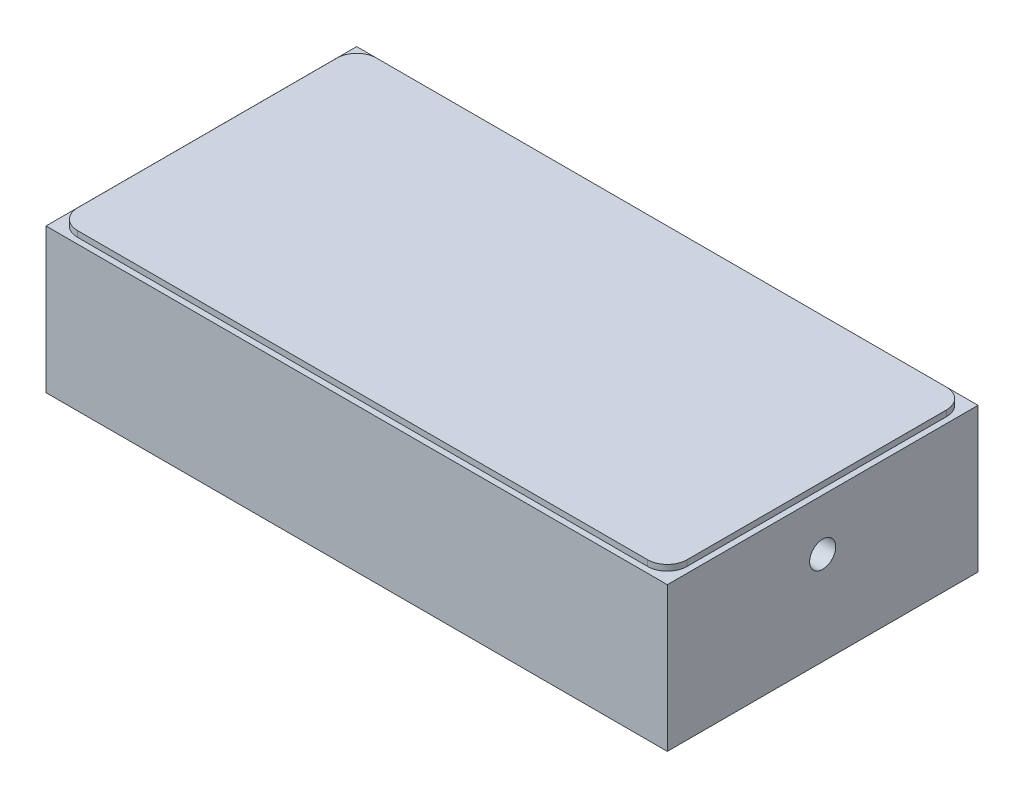
ISO-10303-21;
HEADER;
FILE_DESCRIPTION(('STEP AP214'),'2;1');
FILE_NAME('part.step','',(''),(''),'','','');
FILE_SCHEMA(('AUTOMOTIVE_DESIGN { 1 0 10303 214 1 1 1 1 }'));
ENDSEC;
DATA;
#1=APPLICATION_CONTEXT('core data for automotive mechanical design processes');
#2=APPLICATION_PROTOCOL_DEFINITION('international standard','automotive_design',2000,#1);
#3=PRODUCT_CONTEXT('',#1,'mechanical');
#4=PRODUCT('Part','Part','',(#3));
#5=PRODUCT_RELATED_PRODUCT_CATEGORY('part','',(#4));
#6=PRODUCT_DEFINITION_FORMATION('','',#4);
#7=PRODUCT_DEFINITION_CONTEXT('part definition',#1,'design');
#8=PRODUCT_DEFINITION('design','',#6,#7);
#9=PRODUCT_DEFINITION_SHAPE('','',#8);
#10=(LENGTH_UNIT() NAMED_UNIT(*) SI_UNIT(.MILLI.,.METRE.));
#11=(NAMED_UNIT(*) PLANE_ANGLE_UNIT() SI_UNIT($,.RADIAN.));
#12=(NAMED_UNIT(*) SI_UNIT($,.STERADIAN.) SOLID_ANGLE_UNIT());
#13=UNCERTAINTY_MEASURE_WITH_UNIT(LENGTH_MEASURE(1.E-05),#10,'distance_accuracy_value','');
#14=(GEOMETRIC_REPRESENTATION_CONTEXT(3) GLOBAL_UNCERTAINTY_ASSIGNED_CONTEXT((#13)) GLOBAL_UNIT_ASSIGNED_CONTEXT((#10,
#11,#12)) REPRESENTATION_CONTEXT('',''));
#15=CARTESIAN_POINT('',(0.,0.,0.));
#16=DIRECTION('',(0.,0.,1.));
#17=DIRECTION('',(1.,0.,0.));
#18=AXIS2_PLACEMENT_3D('',#15,#16,#17);
#19=CARTESIAN_POINT('',(-49.9999,0.,-25.));
#20=DIRECTION('',(0.,-1.,0.));
#21=DIRECTION('',(0.,0.,-1.));
#22=AXIS2_PLACEMENT_3D('',#19,#20,#21);
#23=PLANE('',#22);
#24=CARTESIAN_POINT('',(-24.9999,0.,0.));
#25=DIRECTION('',(0.,-1.,0.));
#26=DIRECTION('',(0.,0.,-1.));
#27=AXIS2_PLACEMENT_3D('',#24,#25,#26);
#28=CIRCLE('',#27,1.58749999999996);
#29=CARTESIAN_POINT('',(-24.9999,0.,-1.58749999999996));
#30=VERTEX_POINT('',#29);
#31=EDGE_CURVE('E330',#30,#30,#28,.T.);
#32=ORIENTED_EDGE('',*,*,#31,.F.);
#33=EDGE_LOOP('',(#32));
#34=FACE_BOUND('',#33,.T.);
#35=CARTESIAN_POINT('',(10.795,0.,0.));
#36=DIRECTION('',(0.,-1.,0.));
#37=DIRECTION('',(0.,0.,-1.));
#38=AXIS2_PLACEMENT_3D('',#35,#36,#37);
#39=CIRCLE('',#38,1.25);
#40=CARTESIAN_POINT('',(10.795,0.,-1.25));
#41=VERTEX_POINT('',#40);
#42=EDGE_CURVE('E327',#41,#41,#39,.T.);
#43=ORIENTED_EDGE('',*,*,#42,.F.);
#44=EDGE_LOOP('',(#43));
#45=FACE_BOUND('',#44,.T.);
#46=CARTESIAN_POINT('',(-5.39750000000004,0.,-9.34874423385299));
#47=DIRECTION('',(0.,-1.,0.));
#48=DIRECTION('',(0.,0.,-1.));
#49=AXIS2_PLACEMENT_3D('',#46,#47,#48);
#50=CIRCLE('',#49,1.25);
#51=CARTESIAN_POINT('',(-5.39750000000004,0.,-10.598744233853));
#52=VERTEX_POINT('',#51);
#53=EDGE_CURVE('E321',#52,#52,#50,.T.);
#54=ORIENTED_EDGE('',*,*,#53,.F.);
#55=EDGE_LOOP('',(#54));
#56=FACE_BOUND('',#55,.T.);
#57=CARTESIAN_POINT('',(-5.39749999999991,0.,9.34874423385306));
#58=DIRECTION('',(0.,-1.,0.));
#59=DIRECTION('',(0.,0.,-1.));
#60=AXIS2_PLACEMENT_3D('',#57,#58,#59);
#61=CIRCLE('',#60,1.25);
#62=CARTESIAN_POINT('',(-5.39749999999991,0.,8.09874423385307));
#63=VERTEX_POINT('',#62);
#64=EDGE_CURVE('E315',#63,#63,#61,.T.);
#65=ORIENTED_EDGE('',*,*,#64,.F.);
#66=EDGE_LOOP('',(#65));
#67=FACE_BOUND('',#66,.T.);
#68=CARTESIAN_POINT('',(0.,0.,0.));
#69=DIRECTION('',(0.,-1.,0.));
#70=DIRECTION('',(0.,0.,-1.));
#71=AXIS2_PLACEMENT_3D('',#68,#69,#70);
#72=CIRCLE('',#71,6.48252587808178);
#73=CARTESIAN_POINT('',(0.,0.,-6.48252587808178));
#74=VERTEX_POINT('',#73);
#75=EDGE_CURVE('E306',#74,#74,#72,.T.);
#76=ORIENTED_EDGE('',*,*,#75,.F.);
#77=EDGE_LOOP('',(#76));
#78=FACE_BOUND('',#77,.T.);
#79=CARTESIAN_POINT('',(25.0001,0.,0.));
#80=DIRECTION('',(0.,-1.,0.));
#81=DIRECTION('',(0.,0.,-1.));
#82=AXIS2_PLACEMENT_3D('',#79,#80,#81);
#83=CIRCLE('',#82,1.25);
#84=CARTESIAN_POINT('',(25.0001,0.,-1.25));
#85=VERTEX_POINT('',#84);
#86=EDGE_CURVE('E302',#85,#85,#83,.T.);
#87=ORIENTED_EDGE('',*,*,#86,.F.);
#88=EDGE_LOOP('',(#87));
#89=FACE_BOUND('',#88,.T.);
#90=DIRECTION('',(0.,0.,-1.));
#91=VECTOR('',#90,1.);
#92=CARTESIAN_POINT('',(-49.2379,0.,-25.));
#93=LINE('',#92,#91);
#94=CARTESIAN_POINT('',(-49.2379,0.,24.238));
#95=VERTEX_POINT('',#94);
#96=CARTESIAN_POINT('',(-49.2379,0.,-24.238));
#97=VERTEX_POINT('',#96);
#98=EDGE_CURVE('E373',#95,#97,#93,.T.);
#99=ORIENTED_EDGE('',*,*,#98,.T.);
#100=DIRECTION('',(1.,0.,0.));
#101=VECTOR('',#100,1.);
#102=CARTESIAN_POINT('',(49.9999,0.,-24.238));
#103=LINE('',#102,#101);
#104=CARTESIAN_POINT('',(49.2379,0.,-24.238));
#105=VERTEX_POINT('',#104);
#106=EDGE_CURVE('E379',#97,#105,#103,.T.);
#107=ORIENTED_EDGE('',*,*,#106,.T.);
#108=DIRECTION('',(0.,0.,1.));
#109=VECTOR('',#108,1.);
#110=CARTESIAN_POINT('',(49.2379,0.,25.));
#111=LINE('',#110,#109);
#112=CARTESIAN_POINT('',(49.2379,0.,24.238));
#113=VERTEX_POINT('',#112);
#114=EDGE_CURVE('E377',#105,#113,#111,.T.);
#115=ORIENTED_EDGE('',*,*,#114,.T.);
#116=DIRECTION('',(-1.,0.,0.));
#117=VECTOR('',#116,1.);
#118=CARTESIAN_POINT('',(-49.9999,0.,24.238));
#119=LINE('',#118,#117);
#120=EDGE_CURVE('E375',#113,#95,#119,.T.);
#121=ORIENTED_EDGE('',*,*,#120,.T.);
#122=EDGE_LOOP('',(#99,#107,#115,#121));
#123=FACE_BOUND('',#122,.T.);
#124=DIRECTION('',(0.499999999999997,0.,-0.866025403784441));
#125=VECTOR('',#124,1.);
#126=CARTESIAN_POINT('',(36.6937204962138,0.,0.));
#127=LINE('',#126,#125);
#128=CARTESIAN_POINT('',(36.6937204962138,0.,0.));
#129=VERTEX_POINT('',#128);
#130=CARTESIAN_POINT('',(39.0034102481069,0.,-4.00049999999999));
#131=VERTEX_POINT('',#130);
#132=EDGE_CURVE('E885',#129,#131,#127,.T.);
#133=ORIENTED_EDGE('',*,*,#132,.F.);
#134=DIRECTION('',(-0.500000000000002,0.,-0.866025403784437));
#135=VECTOR('',#134,1.);
#136=CARTESIAN_POINT('',(39.0034102481069,0.,4.00050000000001));
#137=LINE('',#136,#135);
#138=CARTESIAN_POINT('',(39.0034102481069,0.,4.00050000000001));
#139=VERTEX_POINT('',#138);
#140=EDGE_CURVE('E217',#139,#129,#137,.T.);
#141=ORIENTED_EDGE('',*,*,#140,.F.);
#142=DIRECTION('',(-1.,0.,0.));
#143=VECTOR('',#142,1.);
#144=CARTESIAN_POINT('',(43.6227897518931,0.,4.00049999999999));
#145=LINE('',#144,#143);
#146=CARTESIAN_POINT('',(43.6227897518931,0.,4.00049999999999));
#147=VERTEX_POINT('',#146);
#148=EDGE_CURVE('E213',#147,#139,#145,.T.);
#149=ORIENTED_EDGE('',*,*,#148,.F.);
#150=DIRECTION('',(-0.499999999999995,0.,0.866025403784441));
#151=VECTOR('',#150,1.);
#152=CARTESIAN_POINT('',(45.9324795037862,0.,0.));
#153=LINE('',#152,#151);
#154=CARTESIAN_POINT('',(45.9324795037862,0.,0.));
#155=VERTEX_POINT('',#154);
#156=EDGE_CURVE('E881',#155,#147,#153,.T.);
#157=ORIENTED_EDGE('',*,*,#156,.F.);
#158=DIRECTION('',(0.499999999999999,0.,0.866025403784439));
#159=VECTOR('',#158,1.);
#160=CARTESIAN_POINT('',(43.6227897518931,0.,-4.00050000000001));
#161=LINE('',#160,#159);
#162=CARTESIAN_POINT('',(43.6227897518931,0.,-4.00050000000001));
#163=VERTEX_POINT('',#162);
#164=EDGE_CURVE('E893',#163,#155,#161,.T.);
#165=ORIENTED_EDGE('',*,*,#164,.F.);
#166=DIRECTION('',(1.,0.,0.));
#167=VECTOR('',#166,1.);
#168=CARTESIAN_POINT('',(39.0034102481069,0.,-4.00049999999999));
#169=LINE('',#168,#167);
#170=EDGE_CURVE('E887',#131,#163,#169,.T.);
#171=ORIENTED_EDGE('',*,*,#170,.F.);
#172=EDGE_LOOP('',(#133,#141,#149,#157,#165,#171));
#173=FACE_BOUND('',#172,.T.);
#174=ADVANCED_FACE('F44',(#34,#45,#56,#67,#78,#89,#123,#173),#23,.T.);
#175=CARTESIAN_POINT('',(-49.9999,24.003,-25.));
#176=DIRECTION('',(0.,-1.,0.));
#177=DIRECTION('',(0.,0.,-1.));
#178=AXIS2_PLACEMENT_3D('',#175,#176,#177);
#179=PLANE('',#178);
#180=DIRECTION('',(0.,0.,1.));
#181=VECTOR('',#180,1.);
#182=CARTESIAN_POINT('',(-49.9999,24.003,25.));
#183=LINE('',#182,#181);
#184=CARTESIAN_POINT('',(-49.9999,24.003,-25.));
#185=VERTEX_POINT('',#184);
#186=CARTESIAN_POINT('',(-49.9999,24.003,25.));
#187=VERTEX_POINT('',#186);
#188=EDGE_CURVE('E336',#185,#187,#183,.T.);
#189=ORIENTED_EDGE('',*,*,#188,.T.);
#190=DIRECTION('',(1.,0.,0.));
#191=VECTOR('',#190,1.);
#192=CARTESIAN_POINT('',(-49.9999,24.003,25.));
#193=LINE('',#192,#191);
#194=CARTESIAN_POINT('',(49.9999,24.003,25.));
#195=VERTEX_POINT('',#194);
#196=EDGE_CURVE('E339',#187,#195,#193,.T.);
#197=ORIENTED_EDGE('',*,*,#196,.T.);
#198=DIRECTION('',(0.,0.,-1.));
#199=VECTOR('',#198,1.);
#200=CARTESIAN_POINT('',(49.9999,24.003,25.));
#201=LINE('',#200,#199);
#202=CARTESIAN_POINT('',(49.9999,24.003,-25.));
#203=VERTEX_POINT('',#202);
#204=EDGE_CURVE('E341',#195,#203,#201,.T.);
#205=ORIENTED_EDGE('',*,*,#204,.T.);
#206=DIRECTION('',(-1.,0.,0.));
#207=VECTOR('',#206,1.);
#208=CARTESIAN_POINT('',(-49.9999,24.003,-25.));
#209=LINE('',#208,#207);
#210=EDGE_CURVE('E343',#203,#185,#209,.T.);
#211=ORIENTED_EDGE('',*,*,#210,.T.);
#212=EDGE_LOOP('',(#189,#197,#205,#211));
#213=FACE_BOUND('',#212,.T.);
#214=CARTESIAN_POINT('',(-45.8724,24.003,20.8725));
#215=DIRECTION('',(0.,1.,0.));
#216=DIRECTION('',(0.,0.,-1.));
#217=AXIS2_PLACEMENT_3D('',#214,#215,#216);
#218=CIRCLE('',#217,3.175);
#219=CARTESIAN_POINT('',(-49.0474,24.003,20.8725));
#220=VERTEX_POINT('',#219);
#221=CARTESIAN_POINT('',(-45.8724,24.003,24.0475));
#222=VERTEX_POINT('',#221);
#223=EDGE_CURVE('E222',#220,#222,#218,.T.);
#224=ORIENTED_EDGE('',*,*,#223,.F.);
#225=DIRECTION('',(0.,0.,1.));
#226=VECTOR('',#225,1.);
#227=CARTESIAN_POINT('',(-49.0474,24.003,20.8725));
#228=LINE('',#227,#226);
#229=CARTESIAN_POINT('',(-49.0474,24.003,-20.8851));
#230=VERTEX_POINT('',#229);
#231=EDGE_CURVE('E232',#230,#220,#228,.T.);
#232=ORIENTED_EDGE('',*,*,#231,.F.);
#233=CARTESIAN_POINT('',(-45.8724,24.003,-20.8851));
#234=DIRECTION('',(0.,1.,0.));
#235=DIRECTION('',(0.,0.,-1.));
#236=AXIS2_PLACEMENT_3D('',#233,#234,#235);
#237=CIRCLE('',#236,3.175);
#238=CARTESIAN_POINT('',(-45.8724,24.003,-24.0601));
#239=VERTEX_POINT('',#238);
#240=EDGE_CURVE('E262',#239,#230,#237,.T.);
#241=ORIENTED_EDGE('',*,*,#240,.F.);
#242=DIRECTION('',(-1.,0.,0.));
#243=VECTOR('',#242,1.);
#244=CARTESIAN_POINT('',(-45.8724,24.003,-24.0601));
#245=LINE('',#244,#243);
#246=CARTESIAN_POINT('',(45.8724,24.003,-24.0601));
#247=VERTEX_POINT('',#246);
#248=EDGE_CURVE('E259',#247,#239,#245,.T.);
#249=ORIENTED_EDGE('',*,*,#248,.F.);
#250=CARTESIAN_POINT('',(45.8724,24.003,-20.8851));
#251=DIRECTION('',(0.,1.,0.));
#252=DIRECTION('',(0.,0.,-1.));
#253=AXIS2_PLACEMENT_3D('',#250,#251,#252);
#254=CIRCLE('',#253,3.175);
#255=CARTESIAN_POINT('',(49.0474,24.003,-20.8851));
#256=VERTEX_POINT('',#255);
#257=EDGE_CURVE('E256',#256,#247,#254,.T.);
#258=ORIENTED_EDGE('',*,*,#257,.F.);
#259=DIRECTION('',(0.,0.,-1.));
#260=VECTOR('',#259,1.);
#261=CARTESIAN_POINT('',(49.0474,24.003,20.8725));
#262=LINE('',#261,#260);
#263=CARTESIAN_POINT('',(49.0474,24.003,20.8725));
#264=VERTEX_POINT('',#263);
#265=EDGE_CURVE('E253',#264,#256,#262,.T.);
#266=ORIENTED_EDGE('',*,*,#265,.F.);
#267=CARTESIAN_POINT('',(45.8724,24.003,20.8725));
#268=DIRECTION('',(0.,1.,0.));
#269=DIRECTION('',(0.,0.,1.));
#270=AXIS2_PLACEMENT_3D('',#267,#268,#269);
#271=CIRCLE('',#270,3.175);
#272=CARTESIAN_POINT('',(45.8724,24.003,24.0475));
#273=VERTEX_POINT('',#272);
#274=EDGE_CURVE('E250',#273,#264,#271,.T.);
#275=ORIENTED_EDGE('',*,*,#274,.F.);
#276=DIRECTION('',(1.,0.,0.));
#277=VECTOR('',#276,1.);
#278=CARTESIAN_POINT('',(-45.8724,24.003,24.0475));
#279=LINE('',#278,#277);
#280=EDGE_CURVE('E69',#222,#273,#279,.T.);
#281=ORIENTED_EDGE('',*,*,#280,.F.);
#282=EDGE_LOOP('',(#224,#232,#241,#249,#258,#266,#275,#281));
#283=FACE_BOUND('',#282,.T.);
#284=ADVANCED_FACE('F421',(#213,#283),#179,.F.);
#285=CARTESIAN_POINT('',(49.9999,15.748,0.));
#286=DIRECTION('',(1.,0.,0.));
#287=DIRECTION('',(0.,0.,-1.));
#288=AXIS2_PLACEMENT_3D('',#285,#286,#287);
#289=CYLINDRICAL_SURFACE('',#288,2.09999999999999);
#290=CARTESIAN_POINT('',(49.9999,15.748,0.));
#291=DIRECTION('',(1.,0.,0.));
#292=DIRECTION('',(0.,0.,-1.));
#293=AXIS2_PLACEMENT_3D('',#290,#291,#292);
#294=CIRCLE('',#293,2.09999999999999);
#295=CARTESIAN_POINT('',(49.9999,15.748,-2.09999999999999));
#296=VERTEX_POINT('',#295);
#297=EDGE_CURVE('E296',#296,#296,#294,.T.);
#298=ORIENTED_EDGE('',*,*,#297,.T.);
#299=EDGE_LOOP('',(#298));
#300=FACE_BOUND('',#299,.T.);
#301=CARTESIAN_POINT('',(41.3131,15.748,0.));
#302=DIRECTION('',(0.707106781186547,0.707106781186547,0.));
#303=DIRECTION('',(0.707106781186547,-0.707106781186547,0.));
#304=AXIS2_PLACEMENT_3D('',#301,#302,#303);
#305=ELLIPSE('',#304,2.96984848098349,2.09999999999999);
#306=CARTESIAN_POINT('',(41.3131,15.748,-2.09999999999999));
#307=VERTEX_POINT('',#306);
#308=CARTESIAN_POINT('',(41.3131,15.748,2.09999999999999));
#309=VERTEX_POINT('',#308);
#310=EDGE_CURVE('E357',#307,#309,#305,.F.);
#311=ORIENTED_EDGE('',*,*,#310,.T.);
#312=CARTESIAN_POINT('',(41.3131,15.748,0.));
#313=DIRECTION('',(0.707106781186547,-0.707106781186547,0.));
#314=DIRECTION('',(0.707106781186547,0.707106781186547,0.));
#315=AXIS2_PLACEMENT_3D('',#312,#313,#314);
#316=ELLIPSE('',#315,2.96984848098349,2.09999999999999);
#317=EDGE_CURVE('E367',#309,#307,#316,.F.);
#318=ORIENTED_EDGE('',*,*,#317,.T.);
#319=EDGE_LOOP('',(#311,#318));
#320=FACE_BOUND('',#319,.T.);
#321=ADVANCED_FACE('F436',(#300,#320),#289,.F.);
#322=CARTESIAN_POINT('',(-49.9999,24.003,25.));
#323=DIRECTION('',(1.,0.,0.));
#324=DIRECTION('',(0.,0.,-1.));
#325=AXIS2_PLACEMENT_3D('',#322,#323,#324);
#326=PLANE('',#325);
#327=DIRECTION('',(0.,-1.,0.));
#328=VECTOR('',#327,1.);
#329=CARTESIAN_POINT('',(-49.9999,24.003,-25.));
#330=LINE('',#329,#328);
#331=CARTESIAN_POINT('',(-49.9999,0.762000000000013,-25.));
#332=VERTEX_POINT('',#331);
#333=EDGE_CURVE('E345',#185,#332,#330,.T.);
#334=ORIENTED_EDGE('',*,*,#333,.T.);
#335=DIRECTION('',(0.,0.,1.));
#336=VECTOR('',#335,1.);
#337=CARTESIAN_POINT('',(-49.9999,0.762000000000013,25.));
#338=LINE('',#337,#336);
#339=CARTESIAN_POINT('',(-49.9999,0.762000000000013,25.));
#340=VERTEX_POINT('',#339);
#341=EDGE_CURVE('E13',#332,#340,#338,.T.);
#342=ORIENTED_EDGE('',*,*,#341,.T.);
#343=DIRECTION('',(0.,-1.,0.));
#344=VECTOR('',#343,1.);
#345=CARTESIAN_POINT('',(-49.9999,24.003,25.));
#346=LINE('',#345,#344);
#347=EDGE_CURVE('E354',#187,#340,#346,.T.);
#348=ORIENTED_EDGE('',*,*,#347,.F.);
#349=ORIENTED_EDGE('',*,*,#188,.F.);
#350=EDGE_LOOP('',(#334,#342,#348,#349));
#351=FACE_BOUND('',#350,.T.);
#352=ADVANCED_FACE('F419',(#351),#326,.F.);
#353=CARTESIAN_POINT('',(-49.9999,24.003,25.));
#354=DIRECTION('',(0.,0.,-1.));
#355=DIRECTION('',(-1.,0.,0.));
#356=AXIS2_PLACEMENT_3D('',#353,#354,#355);
#357=PLANE('',#356);
#358=ORIENTED_EDGE('',*,*,#347,.T.);
#359=DIRECTION('',(1.,0.,0.));
#360=VECTOR('',#359,1.);
#361=CARTESIAN_POINT('',(49.9999,0.762000000000013,25.));
#362=LINE('',#361,#360);
#363=CARTESIAN_POINT('',(49.9999,0.762000000000013,25.));
#364=VERTEX_POINT('',#363);
#365=EDGE_CURVE('E53',#340,#364,#362,.T.);
#366=ORIENTED_EDGE('',*,*,#365,.T.);
#367=DIRECTION('',(0.,-1.,0.));
#368=VECTOR('',#367,1.);
#369=CARTESIAN_POINT('',(49.9999,24.003,25.));
#370=LINE('',#369,#368);
#371=EDGE_CURVE('E351',#195,#364,#370,.T.);
#372=ORIENTED_EDGE('',*,*,#371,.F.);
#373=ORIENTED_EDGE('',*,*,#196,.F.);
#374=EDGE_LOOP('',(#358,#366,#372,#373));
#375=FACE_BOUND('',#374,.T.);
#376=ADVANCED_FACE('F427',(#375),#357,.F.);
#377=CARTESIAN_POINT('',(49.9999,24.003,25.));
#378=DIRECTION('',(-1.,0.,0.));
#379=DIRECTION('',(0.,0.,1.));
#380=AXIS2_PLACEMENT_3D('',#377,#378,#379);
#381=PLANE('',#380);
#382=ORIENTED_EDGE('',*,*,#297,.F.);
#383=EDGE_LOOP('',(#382));
#384=FACE_BOUND('',#383,.T.);
#385=ORIENTED_EDGE('',*,*,#371,.T.);
#386=DIRECTION('',(0.,0.,-1.));
#387=VECTOR('',#386,1.);
#388=CARTESIAN_POINT('',(49.9999,0.762000000000013,-25.));
#389=LINE('',#388,#387);
#390=CARTESIAN_POINT('',(49.9999,0.762000000000013,-25.));
#391=VERTEX_POINT('',#390);
#392=EDGE_CURVE('E382',#364,#391,#389,.T.);
#393=ORIENTED_EDGE('',*,*,#392,.T.);
#394=DIRECTION('',(0.,-1.,0.));
#395=VECTOR('',#394,1.);
#396=CARTESIAN_POINT('',(49.9999,24.003,-25.));
#397=LINE('',#396,#395);
#398=EDGE_CURVE('E348',#203,#391,#397,.T.);
#399=ORIENTED_EDGE('',*,*,#398,.F.);
#400=ORIENTED_EDGE('',*,*,#204,.F.);
#401=EDGE_LOOP('',(#385,#393,#399,#400));
#402=FACE_BOUND('',#401,.T.);
#403=ADVANCED_FACE('F425',(#384,#402),#381,.F.);
#404=CARTESIAN_POINT('',(-49.9999,24.003,-25.));
#405=DIRECTION('',(0.,0.,1.));
#406=DIRECTION('',(1.,0.,0.));
#407=AXIS2_PLACEMENT_3D('',#404,#405,#406);
#408=PLANE('',#407);
#409=ORIENTED_EDGE('',*,*,#398,.T.);
#410=DIRECTION('',(-1.,0.,0.));
#411=VECTOR('',#410,1.);
#412=CARTESIAN_POINT('',(-49.9999,0.762000000000013,-25.));
#413=LINE('',#412,#411);
#414=EDGE_CURVE('E370',#391,#332,#413,.T.);
#415=ORIENTED_EDGE('',*,*,#414,.T.);
#416=ORIENTED_EDGE('',*,*,#333,.F.);
#417=ORIENTED_EDGE('',*,*,#210,.F.);
#418=EDGE_LOOP('',(#409,#415,#416,#417));
#419=FACE_BOUND('',#418,.T.);
#420=ADVANCED_FACE('F415',(#419),#408,.F.);
#421=CARTESIAN_POINT('',(-24.9999,5.08,0.));
#422=DIRECTION('',(0.,1.,0.));
#423=DIRECTION('',(0.,0.,1.));
#424=AXIS2_PLACEMENT_3D('',#421,#422,#423);
#425=PLANE('',#424);
#426=CARTESIAN_POINT('',(-24.9999,5.08,0.));
#427=DIRECTION('',(0.,-1.,0.));
#428=DIRECTION('',(0.,0.,-1.));
#429=AXIS2_PLACEMENT_3D('',#426,#427,#428);
#430=CIRCLE('',#429,1.5875);
#431=CARTESIAN_POINT('',(-24.9999,5.08,-1.5875));
#432=VERTEX_POINT('',#431);
#433=EDGE_CURVE('E333',#432,#432,#430,.T.);
#434=ORIENTED_EDGE('',*,*,#433,.T.);
#435=EDGE_LOOP('',(#434));
#436=FACE_BOUND('',#435,.T.);
#437=ADVANCED_FACE('F450',(#436),#425,.F.);
#438=CARTESIAN_POINT('',(-24.9999,0.,0.));
#439=DIRECTION('',(0.,-1.,0.));
#440=DIRECTION('',(0.,0.,-1.));
#441=AXIS2_PLACEMENT_3D('',#438,#439,#440);
#442=CYLINDRICAL_SURFACE('',#441,1.58749999999998);
#443=ORIENTED_EDGE('',*,*,#433,.F.);
#444=EDGE_LOOP('',(#443));
#445=FACE_BOUND('',#444,.T.);
#446=ORIENTED_EDGE('',*,*,#31,.T.);
#447=EDGE_LOOP('',(#446));
#448=FACE_BOUND('',#447,.T.);
#449=ADVANCED_FACE('F454',(#445,#448),#442,.F.);
#450=CARTESIAN_POINT('',(10.795,0.,0.));
#451=DIRECTION('',(0.,-1.,0.));
#452=DIRECTION('',(0.,0.,-1.));
#453=AXIS2_PLACEMENT_3D('',#450,#451,#452);
#454=CYLINDRICAL_SURFACE('',#453,1.25);
#455=CARTESIAN_POINT('',(10.795,6.35,0.));
#456=DIRECTION('',(0.,-1.,0.));
#457=DIRECTION('',(0.,0.,-1.));
#458=AXIS2_PLACEMENT_3D('',#455,#456,#457);
#459=CIRCLE('',#458,1.25);
#460=CARTESIAN_POINT('',(10.795,6.35,-1.25));
#461=VERTEX_POINT('',#460);
#462=EDGE_CURVE('E324',#461,#461,#459,.T.);
#463=ORIENTED_EDGE('',*,*,#462,.F.);
#464=EDGE_LOOP('',(#463));
#465=FACE_BOUND('',#464,.T.);
#466=ORIENTED_EDGE('',*,*,#42,.T.);
#467=EDGE_LOOP('',(#466));
#468=FACE_BOUND('',#467,.T.);
#469=ADVANCED_FACE('F459',(#465,#468),#454,.F.);
#470=CARTESIAN_POINT('',(10.795,6.35,0.));
#471=DIRECTION('',(0.,1.,0.));
#472=DIRECTION('',(0.,0.,1.));
#473=AXIS2_PLACEMENT_3D('',#470,#471,#472);
#474=PLANE('',#473);
#475=ORIENTED_EDGE('',*,*,#462,.T.);
#476=EDGE_LOOP('',(#475));
#477=FACE_BOUND('',#476,.T.);
#478=ADVANCED_FACE('F465',(#477),#474,.F.);
#479=CARTESIAN_POINT('',(-5.39750000000004,0.,-9.34874423385299));
#480=DIRECTION('',(0.,-1.,0.));
#481=DIRECTION('',(0.,0.,-1.));
#482=AXIS2_PLACEMENT_3D('',#479,#480,#481);
#483=CYLINDRICAL_SURFACE('',#482,1.25);
#484=CARTESIAN_POINT('',(-5.39750000000004,6.35,-9.34874423385299));
#485=DIRECTION('',(0.,-1.,0.));
#486=DIRECTION('',(0.,0.,-1.));
#487=AXIS2_PLACEMENT_3D('',#484,#485,#486);
#488=CIRCLE('',#487,1.25);
#489=CARTESIAN_POINT('',(-5.39750000000004,6.35,-10.598744233853));
#490=VERTEX_POINT('',#489);
#491=EDGE_CURVE('E318',#490,#490,#488,.T.);
#492=ORIENTED_EDGE('',*,*,#491,.F.);
#493=EDGE_LOOP('',(#492));
#494=FACE_BOUND('',#493,.T.);
#495=ORIENTED_EDGE('',*,*,#53,.T.);
#496=EDGE_LOOP('',(#495));
#497=FACE_BOUND('',#496,.T.);
#498=ADVANCED_FACE('F469',(#494,#497),#483,.F.);
#499=CARTESIAN_POINT('',(-5.39750000000005,6.35,-9.34874423385299));
#500=DIRECTION('',(0.,1.,0.));
#501=DIRECTION('',(0.,0.,1.));
#502=AXIS2_PLACEMENT_3D('',#499,#500,#501);
#503=PLANE('',#502);
#504=ORIENTED_EDGE('',*,*,#491,.T.);
#505=EDGE_LOOP('',(#504));
#506=FACE_BOUND('',#505,.T.);
#507=ADVANCED_FACE('F473',(#506),#503,.F.);
#508=CARTESIAN_POINT('',(-5.39749999999991,0.,9.34874423385306));
#509=DIRECTION('',(0.,-1.,0.));
#510=DIRECTION('',(0.,0.,-1.));
#511=AXIS2_PLACEMENT_3D('',#508,#509,#510);
#512=CYLINDRICAL_SURFACE('',#511,1.25);
#513=CARTESIAN_POINT('',(-5.39749999999991,6.35,9.34874423385306));
#514=DIRECTION('',(0.,-1.,0.));
#515=DIRECTION('',(0.,0.,-1.));
#516=AXIS2_PLACEMENT_3D('',#513,#514,#515);
#517=CIRCLE('',#516,1.25);
#518=CARTESIAN_POINT('',(-5.39749999999991,6.35,8.09874423385307));
#519=VERTEX_POINT('',#518);
#520=EDGE_CURVE('E312',#519,#519,#517,.T.);
#521=ORIENTED_EDGE('',*,*,#520,.F.);
#522=EDGE_LOOP('',(#521));
#523=FACE_BOUND('',#522,.T.);
#524=ORIENTED_EDGE('',*,*,#64,.T.);
#525=EDGE_LOOP('',(#524));
#526=FACE_BOUND('',#525,.T.);
#527=ADVANCED_FACE('F477',(#523,#526),#512,.F.);
#528=CARTESIAN_POINT('',(-5.39749999999991,6.35,9.34874423385306));
#529=DIRECTION('',(0.,1.,0.));
#530=DIRECTION('',(0.,0.,1.));
#531=AXIS2_PLACEMENT_3D('',#528,#529,#530);
#532=PLANE('',#531);
#533=ORIENTED_EDGE('',*,*,#520,.T.);
#534=EDGE_LOOP('',(#533));
#535=FACE_BOUND('',#534,.T.);
#536=ADVANCED_FACE('F481',(#535),#532,.F.);
#537=CARTESIAN_POINT('',(0.,-0.508,0.));
#538=DIRECTION('',(0.,0.,-1.));
#539=DIRECTION('',(1.,0.,0.));
#540=AXIS2_PLACEMENT_3D('',#537,#538,#539);
#541=SPHERICAL_SURFACE('',#540,6.5024);
#542=CARTESIAN_POINT('',(0.,-0.508,0.));
#543=DIRECTION('',(0.,-1.,0.));
#544=DIRECTION('',(0.,0.,-1.));
#545=AXIS2_PLACEMENT_3D('',#542,#543,#544);
#546=SPHERICAL_SURFACE('',#545,6.5024);
#547=ORIENTED_EDGE('',*,*,#75,.T.);
#548=EDGE_LOOP('',(#547));
#549=FACE_BOUND('',#548,.T.);
#550=CARTESIAN_POINT('',(0.,5.54269039015384,0.));
#551=DIRECTION('',(0.,-1.,0.));
#552=DIRECTION('',(0.,0.,-1.));
#553=AXIS2_PLACEMENT_3D('',#550,#551,#552);
#554=CIRCLE('',#553,2.38125);
#555=CARTESIAN_POINT('',(0.,5.54269039015384,-2.38125));
#556=VERTEX_POINT('',#555);
#557=EDGE_CURVE('E305',#556,#556,#554,.T.);
#558=ORIENTED_EDGE('',*,*,#557,.F.);
#559=EDGE_LOOP('',(#558));
#560=FACE_BOUND('',#559,.T.);
#561=ADVANCED_FACE('F485',(#549,#560),#546,.F.);
#562=CARTESIAN_POINT('',(0.,6.2484,0.));
#563=DIRECTION('',(0.,1.,0.));
#564=DIRECTION('',(0.,0.,1.));
#565=AXIS2_PLACEMENT_3D('',#562,#563,#564);
#566=PLANE('',#565);
#567=CARTESIAN_POINT('',(0.,6.2484,0.));
#568=DIRECTION('',(0.,-1.,0.));
#569=DIRECTION('',(0.,0.,-1.));
#570=AXIS2_PLACEMENT_3D('',#567,#568,#569);
#571=CIRCLE('',#570,2.38125);
#572=CARTESIAN_POINT('',(0.,6.2484,-2.38125));
#573=VERTEX_POINT('',#572);
#574=EDGE_CURVE('E309',#573,#573,#571,.T.);
#575=ORIENTED_EDGE('',*,*,#574,.T.);
#576=EDGE_LOOP('',(#575));
#577=FACE_BOUND('',#576,.T.);
#578=ADVANCED_FACE('F491',(#577),#566,.F.);
#579=CARTESIAN_POINT('',(0.,0.,0.));
#580=DIRECTION('',(0.,-1.,0.));
#581=DIRECTION('',(0.,0.,-1.));
#582=AXIS2_PLACEMENT_3D('',#579,#580,#581);
#583=CYLINDRICAL_SURFACE('',#582,2.38125);
#584=ORIENTED_EDGE('',*,*,#557,.T.);
#585=EDGE_LOOP('',(#584));
#586=FACE_BOUND('',#585,.T.);
#587=ORIENTED_EDGE('',*,*,#574,.F.);
#588=EDGE_LOOP('',(#587));
#589=FACE_BOUND('',#588,.T.);
#590=ADVANCED_FACE('F487',(#586,#589),#583,.F.);
#591=CARTESIAN_POINT('',(25.0001,0.,0.));
#592=DIRECTION('',(0.,-1.,0.));
#593=DIRECTION('',(0.,0.,-1.));
#594=AXIS2_PLACEMENT_3D('',#591,#592,#593);
#595=CYLINDRICAL_SURFACE('',#594,1.25);
#596=CARTESIAN_POINT('',(25.0001,5.801995,0.));
#597=DIRECTION('',(0.,-1.,0.));
#598=DIRECTION('',(0.,0.,-1.));
#599=AXIS2_PLACEMENT_3D('',#596,#597,#598);
#600=CIRCLE('',#599,1.25);
#601=CARTESIAN_POINT('',(25.0001,5.801995,-1.25));
#602=VERTEX_POINT('',#601);
#603=EDGE_CURVE('E299',#602,#602,#600,.T.);
#604=ORIENTED_EDGE('',*,*,#603,.F.);
#605=EDGE_LOOP('',(#604));
#606=FACE_BOUND('',#605,.T.);
#607=ORIENTED_EDGE('',*,*,#86,.T.);
#608=EDGE_LOOP('',(#607));
#609=FACE_BOUND('',#608,.T.);
#610=ADVANCED_FACE('F490',(#606,#609),#595,.F.);
#611=CARTESIAN_POINT('',(25.0001,5.801995,0.));
#612=DIRECTION('',(0.,-1.,0.));
#613=DIRECTION('',(0.,0.,-1.));
#614=AXIS2_PLACEMENT_3D('',#611,#612,#613);
#615=CONICAL_SURFACE('',#614,1.25,1.02974425867665);
#616=CARTESIAN_POINT('',(25.0001,6.55307077378445,0.));
#617=VERTEX_POINT('',#616);
#618=VERTEX_LOOP('',#617);
#619=FACE_BOUND('',#618,.T.);
#620=ORIENTED_EDGE('',*,*,#603,.T.);
#621=EDGE_LOOP('',(#620));
#622=FACE_BOUND('',#621,.T.);
#623=ADVANCED_FACE('F501',(#619,#622),#615,.F.);
#624=CARTESIAN_POINT('',(41.3131,0.,0.));
#625=DIRECTION('',(0.,-1.,0.));
#626=DIRECTION('',(0.,0.,-1.));
#627=AXIS2_PLACEMENT_3D('',#624,#625,#626);
#628=CYLINDRICAL_SURFACE('',#627,2.09999999999999);
#629=CARTESIAN_POINT('',(41.3131,0.,0.));
#630=DIRECTION('',(0.,-1.,0.));
#631=DIRECTION('',(0.,0.,-1.));
#632=AXIS2_PLACEMENT_3D('',#629,#630,#631);
#633=CIRCLE('',#632,2.09999999999999);
#634=CARTESIAN_POINT('',(41.3131,0.,-2.09999999999999));
#635=VERTEX_POINT('',#634);
#636=EDGE_CURVE('E219',#635,#635,#633,.F.);
#637=ORIENTED_EDGE('',*,*,#636,.F.);
#638=EDGE_LOOP('',(#637));
#639=FACE_BOUND('',#638,.T.);
#640=ORIENTED_EDGE('',*,*,#310,.F.);
#641=CARTESIAN_POINT('',(41.3131,15.748,0.));
#642=DIRECTION('',(0.707106781186547,-0.707106781186547,0.));
#643=DIRECTION('',(0.707106781186547,0.707106781186547,0.));
#644=AXIS2_PLACEMENT_3D('',#641,#642,#643);
#645=ELLIPSE('',#644,2.96984848098349,2.09999999999999);
#646=EDGE_CURVE('E364',#309,#307,#645,.T.);
#647=ORIENTED_EDGE('',*,*,#646,.F.);
#648=EDGE_LOOP('',(#640,#647));
#649=FACE_BOUND('',#648,.T.);
#650=ADVANCED_FACE('F505',(#639,#649),#628,.F.);
#651=CARTESIAN_POINT('',(37.2999,15.748,0.));
#652=DIRECTION('',(1.,0.,0.));
#653=DIRECTION('',(0.,0.,-1.));
#654=AXIS2_PLACEMENT_3D('',#651,#652,#653);
#655=CONICAL_SURFACE('',#654,2.1,1.02974425867665);
#656=CARTESIAN_POINT('',(36.0380927000421,15.748,0.));
#657=VERTEX_POINT('',#656);
#658=VERTEX_LOOP('',#657);
#659=FACE_BOUND('',#658,.T.);
#660=CARTESIAN_POINT('',(37.2999,15.748,0.));
#661=DIRECTION('',(1.,0.,0.));
#662=DIRECTION('',(0.,0.,-1.));
#663=AXIS2_PLACEMENT_3D('',#660,#661,#662);
#664=CIRCLE('',#663,2.1);
#665=CARTESIAN_POINT('',(37.2999,15.748,-2.1));
#666=VERTEX_POINT('',#665);
#667=EDGE_CURVE('E293',#666,#666,#664,.T.);
#668=ORIENTED_EDGE('',*,*,#667,.T.);
#669=EDGE_LOOP('',(#668));
#670=FACE_BOUND('',#669,.T.);
#671=ADVANCED_FACE('F511',(#659,#670),#655,.F.);
#672=CARTESIAN_POINT('',(41.3131,15.748,0.));
#673=DIRECTION('',(0.707106781186547,0.707106781186547,0.));
#674=DIRECTION('',(0.707106781186547,-0.707106781186547,0.));
#675=AXIS2_PLACEMENT_3D('',#672,#673,#674);
#676=ELLIPSE('',#675,2.96984848098349,2.09999999999999);
#677=EDGE_CURVE('E361',#307,#309,#676,.T.);
#678=ORIENTED_EDGE('',*,*,#677,.T.);
#679=ORIENTED_EDGE('',*,*,#646,.T.);
#680=EDGE_LOOP('',(#678,#679));
#681=FACE_BOUND('',#680,.T.);
#682=ORIENTED_EDGE('',*,*,#667,.F.);
#683=EDGE_LOOP('',(#682));
#684=FACE_BOUND('',#683,.T.);
#685=ADVANCED_FACE('F507',(#681,#684),#289,.F.);
#686=CARTESIAN_POINT('',(41.3131,24.003,0.));
#687=DIRECTION('',(0.,-1.,0.));
#688=DIRECTION('',(0.,0.,-1.));
#689=AXIS2_PLACEMENT_3D('',#686,#687,#688);
#690=CIRCLE('',#689,2.09999999999999);
#691=CARTESIAN_POINT('',(41.3131,24.003,-2.09999999999999));
#692=VERTEX_POINT('',#691);
#693=EDGE_CURVE('E290',#692,#692,#690,.T.);
#694=ORIENTED_EDGE('',*,*,#693,.F.);
#695=EDGE_LOOP('',(#694));
#696=FACE_BOUND('',#695,.T.);
#697=ORIENTED_EDGE('',*,*,#677,.F.);
#698=ORIENTED_EDGE('',*,*,#317,.F.);
#699=EDGE_LOOP('',(#697,#698));
#700=FACE_BOUND('',#699,.T.);
#701=ADVANCED_FACE('F510',(#696,#700),#628,.F.);
#702=CARTESIAN_POINT('',(-49.9999,0.762000000000013,25.));
#703=DIRECTION('',(0.,-0.707106781186547,0.707106781186547));
#704=DIRECTION('',(0.,-0.707106781186548,-0.707106781186548));
#705=AXIS2_PLACEMENT_3D('',#702,#703,#704);
#706=PLANE('',#705);
#707=DIRECTION('',(-0.577350269189626,0.577350269189626,0.577350269189626));
#708=VECTOR('',#707,1.);
#709=CARTESIAN_POINT('',(-49.9999,0.762000000000013,25.));
#710=LINE('',#709,#708);
#711=EDGE_CURVE('E387',#95,#340,#710,.T.);
#712=ORIENTED_EDGE('',*,*,#711,.F.);
#713=ORIENTED_EDGE('',*,*,#120,.F.);
#714=DIRECTION('',(0.577350269189626,0.577350269189626,0.577350269189626));
#715=VECTOR('',#714,1.);
#716=CARTESIAN_POINT('',(16.6666333333334,-32.5712666666667,-8.33326666666667));
#717=LINE('',#716,#715);
#718=EDGE_CURVE('E48',#364,#113,#717,.F.);
#719=ORIENTED_EDGE('',*,*,#718,.F.);
#720=ORIENTED_EDGE('',*,*,#365,.F.);
#721=EDGE_LOOP('',(#712,#713,#719,#720));
#722=FACE_BOUND('',#721,.T.);
#723=ADVANCED_FACE('F46',(#722),#706,.T.);
#724=CARTESIAN_POINT('',(49.9999,0.762000000000013,25.));
#725=DIRECTION('',(0.707106781186547,-0.707106781186547,0.));
#726=DIRECTION('',(0.707106781186548,0.707106781186548,0.));
#727=AXIS2_PLACEMENT_3D('',#724,#725,#726);
#728=PLANE('',#727);
#729=ORIENTED_EDGE('',*,*,#718,.T.);
#730=ORIENTED_EDGE('',*,*,#114,.F.);
#731=DIRECTION('',(0.577350269189626,0.577350269189626,-0.577350269189626));
#732=VECTOR('',#731,1.);
#733=CARTESIAN_POINT('',(33.3332333333333,-15.9046666666667,-8.33333333333334));
#734=LINE('',#733,#732);
#735=EDGE_CURVE('E386',#391,#105,#734,.F.);
#736=ORIENTED_EDGE('',*,*,#735,.F.);
#737=ORIENTED_EDGE('',*,*,#392,.F.);
#738=EDGE_LOOP('',(#729,#730,#736,#737));
#739=FACE_BOUND('',#738,.T.);
#740=ADVANCED_FACE('F398',(#739),#728,.T.);
#741=CARTESIAN_POINT('',(-49.9999,0.762000000000013,25.));
#742=DIRECTION('',(-0.707106781186547,-0.707106781186547,0.));
#743=DIRECTION('',(0.707106781186548,-0.707106781186548,0.));
#744=AXIS2_PLACEMENT_3D('',#741,#742,#743);
#745=PLANE('',#744);
#746=ORIENTED_EDGE('',*,*,#711,.T.);
#747=ORIENTED_EDGE('',*,*,#341,.F.);
#748=DIRECTION('',(0.577350269189626,-0.577350269189626,0.577350269189626));
#749=VECTOR('',#748,1.);
#750=CARTESIAN_POINT('',(-33.3332333333333,-15.9046666666667,-8.33333333333334));
#751=LINE('',#750,#749);
#752=EDGE_CURVE('E289',#97,#332,#751,.F.);
#753=ORIENTED_EDGE('',*,*,#752,.F.);
#754=ORIENTED_EDGE('',*,*,#98,.F.);
#755=EDGE_LOOP('',(#746,#747,#753,#754));
#756=FACE_BOUND('',#755,.T.);
#757=ADVANCED_FACE('F410',(#756),#745,.T.);
#758=CARTESIAN_POINT('',(-49.9999,0.762000000000013,-25.));
#759=DIRECTION('',(0.,-0.707106781186547,-0.707106781186547));
#760=DIRECTION('',(0.,0.707106781186548,-0.707106781186548));
#761=AXIS2_PLACEMENT_3D('',#758,#759,#760);
#762=PLANE('',#761);
#763=ORIENTED_EDGE('',*,*,#735,.T.);
#764=ORIENTED_EDGE('',*,*,#106,.F.);
#765=ORIENTED_EDGE('',*,*,#752,.T.);
#766=ORIENTED_EDGE('',*,*,#414,.F.);
#767=EDGE_LOOP('',(#763,#764,#765,#766));
#768=FACE_BOUND('',#767,.T.);
#769=ADVANCED_FACE('F408',(#768),#762,.T.);
#770=CARTESIAN_POINT('',(-45.8724,24.003,20.8725));
#771=DIRECTION('',(0.,-1.,0.));
#772=DIRECTION('',(0.,0.,-1.));
#773=AXIS2_PLACEMENT_3D('',#770,#771,#772);
#774=PLANE('',#773);
#775=ORIENTED_EDGE('',*,*,#693,.T.);
#776=EDGE_LOOP('',(#775));
#777=FACE_BOUND('',#776,.T.);
#778=ADVANCED_FACE('F523',(#777),#774,.T.);
#779=CARTESIAN_POINT('',(-45.8724,24.9428,20.8725));
#780=DIRECTION('',(0.,-1.,0.));
#781=DIRECTION('',(0.,0.,-1.));
#782=AXIS2_PLACEMENT_3D('',#779,#780,#781);
#783=CYLINDRICAL_SURFACE('',#782,3.175);
#784=ORIENTED_EDGE('',*,*,#223,.T.);
#785=DIRECTION('',(0.,-1.,0.));
#786=VECTOR('',#785,1.);
#787=CARTESIAN_POINT('',(-45.8724,24.9428,24.0475));
#788=LINE('',#787,#786);
#789=CARTESIAN_POINT('',(-45.8724,24.9428,24.0475));
#790=VERTEX_POINT('',#789);
#791=EDGE_CURVE('E287',#790,#222,#788,.T.);
#792=ORIENTED_EDGE('',*,*,#791,.F.);
#793=CARTESIAN_POINT('',(-45.8724,24.9428,20.8725));
#794=DIRECTION('',(0.,1.,0.));
#795=DIRECTION('',(0.,0.,-1.));
#796=AXIS2_PLACEMENT_3D('',#793,#794,#795);
#797=CIRCLE('',#796,3.175);
#798=CARTESIAN_POINT('',(-49.0474,24.9428,20.8725));
#799=VERTEX_POINT('',#798);
#800=EDGE_CURVE('E228',#799,#790,#797,.T.);
#801=ORIENTED_EDGE('',*,*,#800,.F.);
#802=DIRECTION('',(0.,-1.,0.));
#803=VECTOR('',#802,1.);
#804=CARTESIAN_POINT('',(-49.0474,24.9428,20.8725));
#805=LINE('',#804,#803);
#806=EDGE_CURVE('E246',#799,#220,#805,.T.);
#807=ORIENTED_EDGE('',*,*,#806,.T.);
#808=EDGE_LOOP('',(#784,#792,#801,#807));
#809=FACE_BOUND('',#808,.T.);
#810=ADVANCED_FACE('F519',(#809),#783,.T.);
#811=CARTESIAN_POINT('',(-45.8724,24.9428,24.0475));
#812=DIRECTION('',(0.,0.,-1.));
#813=DIRECTION('',(-1.,0.,0.));
#814=AXIS2_PLACEMENT_3D('',#811,#812,#813);
#815=PLANE('',#814);
#816=ORIENTED_EDGE('',*,*,#280,.T.);
#817=DIRECTION('',(0.,-1.,0.));
#818=VECTOR('',#817,1.);
#819=CARTESIAN_POINT('',(45.8724,24.9428,24.0475));
#820=LINE('',#819,#818);
#821=CARTESIAN_POINT('',(45.8724,24.9428,24.0475));
#822=VERTEX_POINT('',#821);
#823=EDGE_CURVE('E284',#822,#273,#820,.T.);
#824=ORIENTED_EDGE('',*,*,#823,.F.);
#825=DIRECTION('',(1.,0.,0.));
#826=VECTOR('',#825,1.);
#827=CARTESIAN_POINT('',(-45.8724,24.9428,24.0475));
#828=LINE('',#827,#826);
#829=EDGE_CURVE('E231',#790,#822,#828,.T.);
#830=ORIENTED_EDGE('',*,*,#829,.F.);
#831=ORIENTED_EDGE('',*,*,#791,.T.);
#832=EDGE_LOOP('',(#816,#824,#830,#831));
#833=FACE_BOUND('',#832,.T.);
#834=ADVANCED_FACE('F522',(#833),#815,.F.);
#835=CARTESIAN_POINT('',(45.8724,24.9428,20.8725));
#836=DIRECTION('',(0.,-1.,0.));
#837=DIRECTION('',(0.,0.,-1.));
#838=AXIS2_PLACEMENT_3D('',#835,#836,#837);
#839=CYLINDRICAL_SURFACE('',#838,3.175);
#840=ORIENTED_EDGE('',*,*,#274,.T.);
#841=DIRECTION('',(0.,-1.,0.));
#842=VECTOR('',#841,1.);
#843=CARTESIAN_POINT('',(49.0474,24.9428,20.8725));
#844=LINE('',#843,#842);
#845=CARTESIAN_POINT('',(49.0474,24.9428,20.8725));
#846=VERTEX_POINT('',#845);
#847=EDGE_CURVE('E281',#846,#264,#844,.T.);
#848=ORIENTED_EDGE('',*,*,#847,.F.);
#849=CARTESIAN_POINT('',(45.8724,24.9428,20.8725));
#850=DIRECTION('',(0.,1.,0.));
#851=DIRECTION('',(0.,0.,1.));
#852=AXIS2_PLACEMENT_3D('',#849,#850,#851);
#853=CIRCLE('',#852,3.175);
#854=EDGE_CURVE('E234',#822,#846,#853,.T.);
#855=ORIENTED_EDGE('',*,*,#854,.F.);
#856=ORIENTED_EDGE('',*,*,#823,.T.);
#857=EDGE_LOOP('',(#840,#848,#855,#856));
#858=FACE_BOUND('',#857,.T.);
#859=ADVANCED_FACE('F527',(#858),#839,.T.);
#860=CARTESIAN_POINT('',(49.0474,24.9428,20.8725));
#861=DIRECTION('',(-1.,0.,0.));
#862=DIRECTION('',(0.,0.,1.));
#863=AXIS2_PLACEMENT_3D('',#860,#861,#862);
#864=PLANE('',#863);
#865=ORIENTED_EDGE('',*,*,#265,.T.);
#866=DIRECTION('',(0.,-1.,0.));
#867=VECTOR('',#866,1.);
#868=CARTESIAN_POINT('',(49.0474,24.9428,-20.8851));
#869=LINE('',#868,#867);
#870=CARTESIAN_POINT('',(49.0474,24.9428,-20.8851));
#871=VERTEX_POINT('',#870);
#872=EDGE_CURVE('E278',#871,#256,#869,.T.);
#873=ORIENTED_EDGE('',*,*,#872,.F.);
#874=DIRECTION('',(0.,0.,-1.));
#875=VECTOR('',#874,1.);
#876=CARTESIAN_POINT('',(49.0474,24.9428,20.8725));
#877=LINE('',#876,#875);
#878=EDGE_CURVE('E236',#846,#871,#877,.T.);
#879=ORIENTED_EDGE('',*,*,#878,.F.);
#880=ORIENTED_EDGE('',*,*,#847,.T.);
#881=EDGE_LOOP('',(#865,#873,#879,#880));
#882=FACE_BOUND('',#881,.T.);
#883=ADVANCED_FACE('F531',(#882),#864,.F.);
#884=CARTESIAN_POINT('',(45.8724,24.9428,-20.8851));
#885=DIRECTION('',(0.,-1.,0.));
#886=DIRECTION('',(0.,0.,-1.));
#887=AXIS2_PLACEMENT_3D('',#884,#885,#886);
#888=CYLINDRICAL_SURFACE('',#887,3.175);
#889=ORIENTED_EDGE('',*,*,#257,.T.);
#890=DIRECTION('',(0.,-1.,0.));
#891=VECTOR('',#890,1.);
#892=CARTESIAN_POINT('',(45.8724,24.9428,-24.0601));
#893=LINE('',#892,#891);
#894=CARTESIAN_POINT('',(45.8724,24.9428,-24.0601));
#895=VERTEX_POINT('',#894);
#896=EDGE_CURVE('E275',#895,#247,#893,.T.);
#897=ORIENTED_EDGE('',*,*,#896,.F.);
#898=CARTESIAN_POINT('',(45.8724,24.9428,-20.8851));
#899=DIRECTION('',(0.,1.,0.));
#900=DIRECTION('',(0.,0.,-1.));
#901=AXIS2_PLACEMENT_3D('',#898,#899,#900);
#902=CIRCLE('',#901,3.175);
#903=EDGE_CURVE('E238',#871,#895,#902,.T.);
#904=ORIENTED_EDGE('',*,*,#903,.F.);
#905=ORIENTED_EDGE('',*,*,#872,.T.);
#906=EDGE_LOOP('',(#889,#897,#904,#905));
#907=FACE_BOUND('',#906,.T.);
#908=ADVANCED_FACE('F535',(#907),#888,.T.);
#909=CARTESIAN_POINT('',(-45.8724,24.9428,-24.0601));
#910=DIRECTION('',(0.,0.,1.));
#911=DIRECTION('',(1.,0.,0.));
#912=AXIS2_PLACEMENT_3D('',#909,#910,#911);
#913=PLANE('',#912);
#914=ORIENTED_EDGE('',*,*,#248,.T.);
#915=DIRECTION('',(0.,-1.,0.));
#916=VECTOR('',#915,1.);
#917=CARTESIAN_POINT('',(-45.8724,24.9428,-24.0601));
#918=LINE('',#917,#916);
#919=CARTESIAN_POINT('',(-45.8724,24.9428,-24.0601));
#920=VERTEX_POINT('',#919);
#921=EDGE_CURVE('E272',#920,#239,#918,.T.);
#922=ORIENTED_EDGE('',*,*,#921,.F.);
#923=DIRECTION('',(-1.,0.,0.));
#924=VECTOR('',#923,1.);
#925=CARTESIAN_POINT('',(-45.8724,24.9428,-24.0601));
#926=LINE('',#925,#924);
#927=EDGE_CURVE('E240',#895,#920,#926,.T.);
#928=ORIENTED_EDGE('',*,*,#927,.F.);
#929=ORIENTED_EDGE('',*,*,#896,.T.);
#930=EDGE_LOOP('',(#914,#922,#928,#929));
#931=FACE_BOUND('',#930,.T.);
#932=ADVANCED_FACE('F539',(#931),#913,.F.);
#933=CARTESIAN_POINT('',(-45.8724,24.9428,-20.8851));
#934=DIRECTION('',(0.,-1.,0.));
#935=DIRECTION('',(0.,0.,-1.));
#936=AXIS2_PLACEMENT_3D('',#933,#934,#935);
#937=CYLINDRICAL_SURFACE('',#936,3.175);
#938=ORIENTED_EDGE('',*,*,#240,.T.);
#939=DIRECTION('',(0.,-1.,0.));
#940=VECTOR('',#939,1.);
#941=CARTESIAN_POINT('',(-49.0474,24.9428,-20.8851));
#942=LINE('',#941,#940);
#943=CARTESIAN_POINT('',(-49.0474,24.9428,-20.8851));
#944=VERTEX_POINT('',#943);
#945=EDGE_CURVE('E269',#944,#230,#942,.T.);
#946=ORIENTED_EDGE('',*,*,#945,.F.);
#947=CARTESIAN_POINT('',(-45.8724,24.9428,-20.8851));
#948=DIRECTION('',(0.,1.,0.));
#949=DIRECTION('',(0.,0.,-1.));
#950=AXIS2_PLACEMENT_3D('',#947,#948,#949);
#951=CIRCLE('',#950,3.175);
#952=EDGE_CURVE('E242',#920,#944,#951,.T.);
#953=ORIENTED_EDGE('',*,*,#952,.F.);
#954=ORIENTED_EDGE('',*,*,#921,.T.);
#955=EDGE_LOOP('',(#938,#946,#953,#954));
#956=FACE_BOUND('',#955,.T.);
#957=ADVANCED_FACE('F543',(#956),#937,.T.);
#958=CARTESIAN_POINT('',(-49.0474,24.9428,20.8725));
#959=DIRECTION('',(1.,0.,0.));
#960=DIRECTION('',(0.,0.,-1.));
#961=AXIS2_PLACEMENT_3D('',#958,#959,#960);
#962=PLANE('',#961);
#963=ORIENTED_EDGE('',*,*,#231,.T.);
#964=ORIENTED_EDGE('',*,*,#806,.F.);
#965=DIRECTION('',(0.,0.,1.));
#966=VECTOR('',#965,1.);
#967=CARTESIAN_POINT('',(-49.0474,24.9428,20.8725));
#968=LINE('',#967,#966);
#969=EDGE_CURVE('E244',#944,#799,#968,.T.);
#970=ORIENTED_EDGE('',*,*,#969,.F.);
#971=ORIENTED_EDGE('',*,*,#945,.T.);
#972=EDGE_LOOP('',(#963,#964,#970,#971));
#973=FACE_BOUND('',#972,.T.);
#974=ADVANCED_FACE('F547',(#973),#962,.F.);
#975=CARTESIAN_POINT('',(-45.8724,24.9428,20.8725));
#976=DIRECTION('',(0.,-1.,0.));
#977=DIRECTION('',(0.,0.,-1.));
#978=AXIS2_PLACEMENT_3D('',#975,#976,#977);
#979=PLANE('',#978);
#980=ORIENTED_EDGE('',*,*,#800,.T.);
#981=ORIENTED_EDGE('',*,*,#829,.T.);
#982=ORIENTED_EDGE('',*,*,#854,.T.);
#983=ORIENTED_EDGE('',*,*,#878,.T.);
#984=ORIENTED_EDGE('',*,*,#903,.T.);
#985=ORIENTED_EDGE('',*,*,#927,.T.);
#986=ORIENTED_EDGE('',*,*,#952,.T.);
#987=ORIENTED_EDGE('',*,*,#969,.T.);
#988=EDGE_LOOP('',(#980,#981,#982,#983,#984,#985,#986,#987));
#989=FACE_BOUND('',#988,.T.);
#990=ADVANCED_FACE('F551',(#989),#979,.F.);
#991=CARTESIAN_POINT('',(34.3840307443207,0.,-4.00049999999998));
#992=DIRECTION('',(0.,-1.,0.));
#993=DIRECTION('',(0.,0.,-1.));
#994=AXIS2_PLACEMENT_3D('',#991,#992,#993);
#995=PLANE('',#994);
#996=ORIENTED_EDGE('',*,*,#636,.T.);
#997=EDGE_LOOP('',(#996));
#998=FACE_BOUND('',#997,.T.);
#999=ADVANCED_FACE('F558',(#998),#995,.F.);
#1000=CARTESIAN_POINT('',(39.0034102481069,-2.49936,4.00050000000001));
#1001=DIRECTION('',(0.866025403784438,0.,-0.500000000000002));
#1002=DIRECTION('',(-0.500000000000002,0.,-0.866025403784438));
#1003=AXIS2_PLACEMENT_3D('',#1000,#1001,#1002);
#1004=PLANE('',#1003);
#1005=ORIENTED_EDGE('',*,*,#140,.T.);
#1006=DIRECTION('',(0.,1.,0.));
#1007=VECTOR('',#1006,1.);
#1008=CARTESIAN_POINT('',(36.6937204962138,-2.49936,0.));
#1009=LINE('',#1008,#1007);
#1010=CARTESIAN_POINT('',(36.6937204962138,-2.49936,0.));
#1011=VERTEX_POINT('',#1010);
#1012=EDGE_CURVE('E198',#1011,#129,#1009,.T.);
#1013=ORIENTED_EDGE('',*,*,#1012,.F.);
#1014=DIRECTION('',(-0.500000000000002,0.,-0.866025403784437));
#1015=VECTOR('',#1014,1.);
#1016=CARTESIAN_POINT('',(39.0034102481069,-2.49936,4.00050000000001));
#1017=LINE('',#1016,#1015);
#1018=CARTESIAN_POINT('',(39.0034102481069,-2.49936,4.00050000000001));
#1019=VERTEX_POINT('',#1018);
#1020=EDGE_CURVE('E205',#1019,#1011,#1017,.T.);
#1021=ORIENTED_EDGE('',*,*,#1020,.F.);
#1022=DIRECTION('',(0.,1.,0.));
#1023=VECTOR('',#1022,1.);
#1024=CARTESIAN_POINT('',(39.0034102481069,-2.49936,4.00050000000001));
#1025=LINE('',#1024,#1023);
#1026=EDGE_CURVE('E879',#1019,#139,#1025,.T.);
#1027=ORIENTED_EDGE('',*,*,#1026,.T.);
#1028=EDGE_LOOP('',(#1005,#1013,#1021,#1027));
#1029=FACE_BOUND('',#1028,.T.);
#1030=ADVANCED_FACE('F215',(#1029),#1004,.F.);
#1031=CARTESIAN_POINT('',(36.6937204962138,-2.49936,0.));
#1032=DIRECTION('',(0.86602540378444,0.,0.499999999999997));
#1033=DIRECTION('',(0.499999999999997,0.,-0.86602540378444));
#1034=AXIS2_PLACEMENT_3D('',#1031,#1032,#1033);
#1035=PLANE('',#1034);
#1036=ORIENTED_EDGE('',*,*,#132,.T.);
#1037=DIRECTION('',(0.,1.,0.));
#1038=VECTOR('',#1037,1.);
#1039=CARTESIAN_POINT('',(39.0034102481069,-2.49936,-4.00049999999999));
#1040=LINE('',#1039,#1038);
#1041=CARTESIAN_POINT('',(39.0034102481069,-2.49936,-4.00049999999999));
#1042=VERTEX_POINT('',#1041);
#1043=EDGE_CURVE('E201',#1042,#131,#1040,.T.);
#1044=ORIENTED_EDGE('',*,*,#1043,.F.);
#1045=DIRECTION('',(0.499999999999997,0.,-0.866025403784441));
#1046=VECTOR('',#1045,1.);
#1047=CARTESIAN_POINT('',(36.6937204962138,-2.49936,0.));
#1048=LINE('',#1047,#1046);
#1049=EDGE_CURVE('E194',#1011,#1042,#1048,.T.);
#1050=ORIENTED_EDGE('',*,*,#1049,.F.);
#1051=ORIENTED_EDGE('',*,*,#1012,.T.);
#1052=EDGE_LOOP('',(#1036,#1044,#1050,#1051));
#1053=FACE_BOUND('',#1052,.T.);
#1054=ADVANCED_FACE('F196',(#1053),#1035,.F.);
#1055=CARTESIAN_POINT('',(39.0034102481069,-2.49936,-4.00049999999999));
#1056=DIRECTION('',(0.,0.,1.));
#1057=DIRECTION('',(1.,0.,0.));
#1058=AXIS2_PLACEMENT_3D('',#1055,#1056,#1057);
#1059=PLANE('',#1058);
#1060=ORIENTED_EDGE('',*,*,#170,.T.);
#1061=DIRECTION('',(0.,1.,0.));
#1062=VECTOR('',#1061,1.);
#1063=CARTESIAN_POINT('',(43.6227897518931,-2.49936,-4.00050000000001));
#1064=LINE('',#1063,#1062);
#1065=CARTESIAN_POINT('',(43.6227897518931,-2.49936,-4.00050000000001));
#1066=VERTEX_POINT('',#1065);
#1067=EDGE_CURVE('E224',#1066,#163,#1064,.T.);
#1068=ORIENTED_EDGE('',*,*,#1067,.F.);
#1069=DIRECTION('',(1.,0.,0.));
#1070=VECTOR('',#1069,1.);
#1071=CARTESIAN_POINT('',(39.0034102481069,-2.49936,-4.00049999999999));
#1072=LINE('',#1071,#1070);
#1073=EDGE_CURVE('E204',#1042,#1066,#1072,.T.);
#1074=ORIENTED_EDGE('',*,*,#1073,.F.);
#1075=ORIENTED_EDGE('',*,*,#1043,.T.);
#1076=EDGE_LOOP('',(#1060,#1068,#1074,#1075));
#1077=FACE_BOUND('',#1076,.T.);
#1078=ADVANCED_FACE('F564',(#1077),#1059,.F.);
#1079=CARTESIAN_POINT('',(43.6227897518931,-2.49936,-4.00050000000001));
#1080=DIRECTION('',(-0.866025403784439,0.,0.499999999999999));
#1081=DIRECTION('',(0.499999999999999,0.,0.866025403784439));
#1082=AXIS2_PLACEMENT_3D('',#1079,#1080,#1081);
#1083=PLANE('',#1082);
#1084=ORIENTED_EDGE('',*,*,#164,.T.);
#1085=DIRECTION('',(0.,1.,0.));
#1086=VECTOR('',#1085,1.);
#1087=CARTESIAN_POINT('',(45.9324795037862,-2.49936,0.));
#1088=LINE('',#1087,#1086);
#1089=CARTESIAN_POINT('',(45.9324795037862,-2.49936,0.));
#1090=VERTEX_POINT('',#1089);
#1091=EDGE_CURVE('E897',#1090,#155,#1088,.T.);
#1092=ORIENTED_EDGE('',*,*,#1091,.F.);
#1093=DIRECTION('',(0.499999999999999,0.,0.866025403784439));
#1094=VECTOR('',#1093,1.);
#1095=CARTESIAN_POINT('',(43.6227897518931,-2.49936,-4.00050000000001));
#1096=LINE('',#1095,#1094);
#1097=EDGE_CURVE('E904',#1066,#1090,#1096,.T.);
#1098=ORIENTED_EDGE('',*,*,#1097,.F.);
#1099=ORIENTED_EDGE('',*,*,#1067,.T.);
#1100=EDGE_LOOP('',(#1084,#1092,#1098,#1099));
#1101=FACE_BOUND('',#1100,.T.);
#1102=ADVANCED_FACE('F567',(#1101),#1083,.F.);
#1103=CARTESIAN_POINT('',(45.9324795037862,-2.49936,0.));
#1104=DIRECTION('',(-0.866025403784441,0.,-0.499999999999995));
#1105=DIRECTION('',(-0.499999999999995,0.,0.866025403784441));
#1106=AXIS2_PLACEMENT_3D('',#1103,#1104,#1105);
#1107=PLANE('',#1106);
#1108=ORIENTED_EDGE('',*,*,#156,.T.);
#1109=DIRECTION('',(0.,1.,0.));
#1110=VECTOR('',#1109,1.);
#1111=CARTESIAN_POINT('',(43.6227897518931,-2.49936,4.00049999999999));
#1112=LINE('',#1111,#1110);
#1113=CARTESIAN_POINT('',(43.6227897518931,-2.49936,4.00049999999999));
#1114=VERTEX_POINT('',#1113);
#1115=EDGE_CURVE('E61',#1114,#147,#1112,.T.);
#1116=ORIENTED_EDGE('',*,*,#1115,.F.);
#1117=DIRECTION('',(-0.499999999999995,0.,0.866025403784441));
#1118=VECTOR('',#1117,1.);
#1119=CARTESIAN_POINT('',(45.9324795037862,-2.49936,0.));
#1120=LINE('',#1119,#1118);
#1121=EDGE_CURVE('E906',#1090,#1114,#1120,.T.);
#1122=ORIENTED_EDGE('',*,*,#1121,.F.);
#1123=ORIENTED_EDGE('',*,*,#1091,.T.);
#1124=EDGE_LOOP('',(#1108,#1116,#1122,#1123));
#1125=FACE_BOUND('',#1124,.T.);
#1126=ADVANCED_FACE('F571',(#1125),#1107,.F.);
#1127=CARTESIAN_POINT('',(43.6227897518931,-2.49936,4.00049999999999));
#1128=DIRECTION('',(0.,0.,-1.));
#1129=DIRECTION('',(-1.,0.,0.));
#1130=AXIS2_PLACEMENT_3D('',#1127,#1128,#1129);
#1131=PLANE('',#1130);
#1132=ORIENTED_EDGE('',*,*,#148,.T.);
#1133=ORIENTED_EDGE('',*,*,#1026,.F.);
#1134=DIRECTION('',(-1.,0.,0.));
#1135=VECTOR('',#1134,1.);
#1136=CARTESIAN_POINT('',(43.6227897518931,-2.49936,4.00049999999999));
#1137=LINE('',#1136,#1135);
#1138=EDGE_CURVE('E209',#1114,#1019,#1137,.T.);
#1139=ORIENTED_EDGE('',*,*,#1138,.F.);
#1140=ORIENTED_EDGE('',*,*,#1115,.T.);
#1141=EDGE_LOOP('',(#1132,#1133,#1139,#1140));
#1142=FACE_BOUND('',#1141,.T.);
#1143=ADVANCED_FACE('F575',(#1142),#1131,.F.);
#1144=CARTESIAN_POINT('',(34.3840307443207,-2.49936,-4.00049999999998));
#1145=DIRECTION('',(0.,-1.,0.));
#1146=DIRECTION('',(0.,0.,-1.));
#1147=AXIS2_PLACEMENT_3D('',#1144,#1145,#1146);
#1148=PLANE('',#1147);
#1149=ORIENTED_EDGE('',*,*,#1020,.T.);
#1150=ORIENTED_EDGE('',*,*,#1049,.T.);
#1151=ORIENTED_EDGE('',*,*,#1073,.T.);
#1152=ORIENTED_EDGE('',*,*,#1097,.T.);
#1153=ORIENTED_EDGE('',*,*,#1121,.T.);
#1154=ORIENTED_EDGE('',*,*,#1138,.T.);
#1155=EDGE_LOOP('',(#1149,#1150,#1151,#1152,#1153,#1154));
#1156=FACE_BOUND('',#1155,.T.);
#1157=ADVANCED_FACE('F208',(#1156),#1148,.T.);
#1158=CLOSED_SHELL('',(#174,#284,#321,#352,#376,#403,#420,#437,#449,#469,#478,#498,#507,#527,
#536,#561,#578,#590,#610,#623,#650,#671,#685,#701,#723,#740,#757,#769,#778,#810,#834,#859,#883,
#908,#932,#957,#974,#990,#999,#1030,#1054,#1078,#1102,#1126,#1143,#1157));
#1159=MANIFOLD_SOLID_BREP('B2',#1158);
#1160=ADVANCED_BREP_SHAPE_REPRESENTATION('',(#18,#1159),#14);
#1161=SHAPE_DEFINITION_REPRESENTATION(#9,#1160);
ENDSEC;
END-ISO-10303-21;
